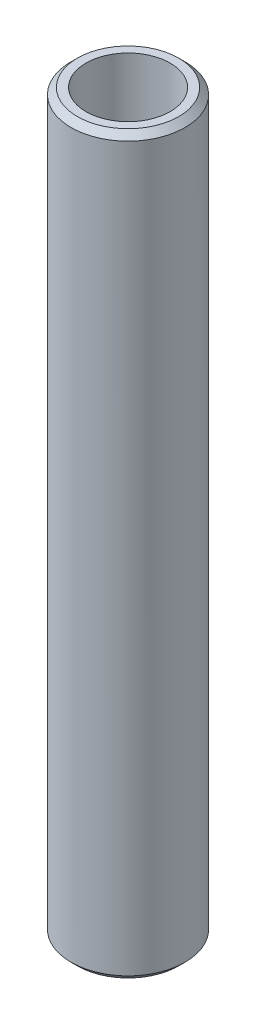
ISO-10303-21;
HEADER;
FILE_DESCRIPTION(('STEP AP214'),'2;1');
FILE_NAME('part.step','',(''),(''),'','','');
FILE_SCHEMA(('AUTOMOTIVE_DESIGN { 1 0 10303 214 1 1 1 1 }'));
ENDSEC;
DATA;
#1=APPLICATION_CONTEXT('core data for automotive mechanical design processes');
#2=APPLICATION_PROTOCOL_DEFINITION('international standard','automotive_design',2000,#1);
#3=PRODUCT_CONTEXT('',#1,'mechanical');
#4=PRODUCT('Part','Part','',(#3));
#5=PRODUCT_RELATED_PRODUCT_CATEGORY('part','',(#4));
#6=PRODUCT_DEFINITION_FORMATION('','',#4);
#7=PRODUCT_DEFINITION_CONTEXT('part definition',#1,'design');
#8=PRODUCT_DEFINITION('design','',#6,#7);
#9=PRODUCT_DEFINITION_SHAPE('','',#8);
#10=(LENGTH_UNIT() NAMED_UNIT(*) SI_UNIT(.MILLI.,.METRE.));
#11=(NAMED_UNIT(*) PLANE_ANGLE_UNIT() SI_UNIT($,.RADIAN.));
#12=(NAMED_UNIT(*) SI_UNIT($,.STERADIAN.) SOLID_ANGLE_UNIT());
#13=UNCERTAINTY_MEASURE_WITH_UNIT(LENGTH_MEASURE(1.E-05),#10,'distance_accuracy_value','');
#14=(GEOMETRIC_REPRESENTATION_CONTEXT(3) GLOBAL_UNCERTAINTY_ASSIGNED_CONTEXT((#13)) GLOBAL_UNIT_ASSIGNED_CONTEXT((#10,
#11,#12)) REPRESENTATION_CONTEXT('',''));
#15=CARTESIAN_POINT('',(0.,0.,0.));
#16=DIRECTION('',(0.,0.,1.));
#17=DIRECTION('',(1.,0.,0.));
#18=AXIS2_PLACEMENT_3D('',#15,#16,#17);
#19=CARTESIAN_POINT('',(0.,419.312782519982,0.));
#20=DIRECTION('',(0.,-1.,0.));
#21=DIRECTION('',(0.,0.,-1.));
#22=AXIS2_PLACEMENT_3D('',#19,#20,#21);
#23=CYLINDRICAL_SURFACE('',#22,32.5);
#24=CARTESIAN_POINT('',(0.,415.711285040093,0.));
#25=DIRECTION('',(0.,1.,0.));
#26=DIRECTION('',(0.,0.,1.));
#27=AXIS2_PLACEMENT_3D('',#24,#25,#26);
#28=CIRCLE('',#27,32.5);
#29=CARTESIAN_POINT('',(0.,415.711285040093,-32.5));
#30=VERTEX_POINT('',#29);
#31=EDGE_CURVE('E50',#30,#30,#28,.F.);
#32=CARTESIAN_POINT('',(0.,3.6014974798888,0.));
#33=DIRECTION('',(0.,1.,0.));
#34=DIRECTION('',(0.,0.,1.));
#35=AXIS2_PLACEMENT_3D('',#32,#33,#34);
#36=CIRCLE('',#35,32.5);
#37=CARTESIAN_POINT('',(0.,3.6014974798888,-32.5));
#38=VERTEX_POINT('',#37);
#39=EDGE_CURVE('E51',#38,#38,#36,.T.);
#40=CARTESIAN_POINT('',(0.,415.711285040093,-32.5));
#41=CARTESIAN_POINT('',(0.,411.418474753008,-32.5));
#42=CARTESIAN_POINT('',(0.,407.125664465922,-32.5));
#43=CARTESIAN_POINT('',(0.,398.540043891751,-32.5));
#44=CARTESIAN_POINT('',(0.,394.247233604666,-32.5));
#45=CARTESIAN_POINT('',(0.,385.661613030495,-32.5));
#46=CARTESIAN_POINT('',(0.,381.368802743409,-32.5));
#47=CARTESIAN_POINT('',(0.,372.783182169238,-32.5));
#48=CARTESIAN_POINT('',(0.,368.490371882153,-32.5));
#49=CARTESIAN_POINT('',(0.,359.904751307982,-32.5));
#50=CARTESIAN_POINT('',(0.,355.611941020897,-32.5));
#51=CARTESIAN_POINT('',(0.,347.026320446726,-32.5));
#52=CARTESIAN_POINT('',(0.,342.73351015964,-32.5));
#53=CARTESIAN_POINT('',(0.,334.147889585469,-32.5));
#54=CARTESIAN_POINT('',(0.,329.855079298384,-32.5));
#55=CARTESIAN_POINT('',(0.,321.269458724213,-32.5));
#56=CARTESIAN_POINT('',(0.,316.976648437127,-32.5));
#57=CARTESIAN_POINT('',(0.,308.391027862957,-32.5));
#58=CARTESIAN_POINT('',(0.,304.098217575871,-32.5));
#59=CARTESIAN_POINT('',(0.,295.5125970017,-32.5));
#60=CARTESIAN_POINT('',(0.,291.219786714615,-32.5));
#61=CARTESIAN_POINT('',(0.,282.634166140444,-32.5));
#62=CARTESIAN_POINT('',(0.,278.341355853358,-32.5));
#63=CARTESIAN_POINT('',(0.,269.755735279187,-32.5));
#64=CARTESIAN_POINT('',(0.,265.462924992102,-32.5));
#65=CARTESIAN_POINT('',(0.,256.877304417931,-32.5));
#66=CARTESIAN_POINT('',(0.,252.584494130846,-32.5));
#67=CARTESIAN_POINT('',(0.,243.998873556675,-32.5));
#68=CARTESIAN_POINT('',(0.,239.706063269589,-32.5));
#69=CARTESIAN_POINT('',(0.,231.120442695418,-32.5));
#70=CARTESIAN_POINT('',(0.,226.827632408333,-32.5));
#71=CARTESIAN_POINT('',(0.,218.242011834162,-32.5));
#72=CARTESIAN_POINT('',(0.,213.949201547076,-32.5));
#73=CARTESIAN_POINT('',(0.,205.363580972905,-32.5));
#74=CARTESIAN_POINT('',(0.,201.07077068582,-32.5));
#75=CARTESIAN_POINT('',(0.,192.485150111649,-32.5));
#76=CARTESIAN_POINT('',(0.,188.192339824564,-32.5));
#77=CARTESIAN_POINT('',(0.,179.606719250393,-32.5));
#78=CARTESIAN_POINT('',(0.,175.313908963307,-32.5));
#79=CARTESIAN_POINT('',(0.,166.728288389136,-32.5));
#80=CARTESIAN_POINT('',(0.,162.435478102051,-32.5));
#81=CARTESIAN_POINT('',(0.,153.84985752788,-32.5));
#82=CARTESIAN_POINT('',(0.,149.557047240795,-32.5));
#83=CARTESIAN_POINT('',(0.,140.971426666624,-32.5));
#84=CARTESIAN_POINT('',(0.,136.678616379538,-32.5));
#85=CARTESIAN_POINT('',(0.,128.092995805367,-32.5));
#86=CARTESIAN_POINT('',(0.,123.800185518282,-32.5));
#87=CARTESIAN_POINT('',(0.,115.214564944111,-32.5));
#88=CARTESIAN_POINT('',(0.,110.921754657025,-32.5));
#89=CARTESIAN_POINT('',(0.,102.336134082854,-32.5));
#90=CARTESIAN_POINT('',(0.,98.0433237957689,-32.5));
#91=CARTESIAN_POINT('',(0.,89.457703221598,-32.5));
#92=CARTESIAN_POINT('',(0.,85.1648929345125,-32.5));
#93=CARTESIAN_POINT('',(0.,76.5792723603416,-32.5));
#94=CARTESIAN_POINT('',(0.,72.2864620732562,-32.5));
#95=CARTESIAN_POINT('',(0.,63.7008414990853,-32.5));
#96=CARTESIAN_POINT('',(0.,59.4080312119999,-32.5));
#97=CARTESIAN_POINT('',(0.,50.8224106378289,-32.5));
#98=CARTESIAN_POINT('',(0.,46.5296003507435,-32.5));
#99=CARTESIAN_POINT('',(0.,37.9439797765725,-32.5));
#100=CARTESIAN_POINT('',(0.,33.6511694894871,-32.5));
#101=CARTESIAN_POINT('',(0.,25.0655489153161,-32.5));
#102=CARTESIAN_POINT('',(0.,20.7727386282307,-32.5));
#103=CARTESIAN_POINT('',(0.,12.1871180540597,-32.5));
#104=CARTESIAN_POINT('',(0.,7.89430776697427,-32.5));
#105=CARTESIAN_POINT('',(0.,3.6014974798888,-32.5));
#106=B_SPLINE_CURVE_WITH_KNOTS('',3,(#40,#41,#42,#43,#44,#45,#46,#47,#48,#49,#50,#51,#52,#53,
#54,#55,#56,#57,#58,#59,#60,#61,#62,#63,#64,#65,#66,#67,#68,#69,#70,#71,#72,#73,#74,#75,#76,#77,
#78,#79,#80,#81,#82,#83,#84,#85,#86,#87,#88,#89,#90,#91,#92,#93,#94,#95,#96,#97,#98,#99,#100,
#101,#102,#103,#104,#105),.UNSPECIFIED.,.F.,.F.,(4,2,2,2,2,2,2,2,2,2,2,2,2,2,2,2,2,2,2,2,2,2,2,
2,2,2,2,2,2,2,2,2,4),(0.,12.8784308612563,25.7568617225127,38.6352925837691,51.5137234450255,
64.3921543062819,77.2705851675383,90.1490160287947,103.027446890051,115.905877751307,
128.784308612564,141.66273947382,154.541170335077,167.419601196333,180.298032057589,
193.176462918846,206.054893780102,218.933324641358,231.811755502615,244.690186363871,
257.568617225128,270.447048086384,283.32547894764,296.203909808897,309.082340670153,
321.96077153141,334.839202392666,347.717633253922,360.596064115179,373.474494976435,
386.352925837691,399.231356698948,412.109787560204),.UNSPECIFIED.);
#107=EDGE_CURVE('BSEAM39',#30,#38,#106,.T.);
#108=ORIENTED_EDGE('',*,*,#31,.T.);
#109=ORIENTED_EDGE('',*,*,#39,.T.);
#110=ORIENTED_EDGE('',*,*,#107,.T.);
#111=ORIENTED_EDGE('',*,*,#107,.F.);
#112=EDGE_LOOP('',(#108,#110,#109,#111));
#113=FACE_BOUND('',#112,.T.);
#114=ADVANCED_FACE('F39',(#113),#23,.T.);
#115=CARTESIAN_POINT('',(0.,419.312782519982,0.));
#116=DIRECTION('',(0.,1.,0.));
#117=DIRECTION('',(0.,0.,1.));
#118=AXIS2_PLACEMENT_3D('',#115,#116,#117);
#119=PLANE('',#118);
#120=CARTESIAN_POINT('',(0.,419.312782519982,0.));
#121=DIRECTION('',(0.,1.,0.));
#122=DIRECTION('',(0.,0.,1.));
#123=AXIS2_PLACEMENT_3D('',#120,#121,#122);
#124=CIRCLE('',#123,28.898502520111);
#125=CARTESIAN_POINT('',(0.,419.312782519982,-28.898502520111));
#126=VERTEX_POINT('',#125);
#127=EDGE_CURVE('E54',#126,#126,#124,.T.);
#128=ORIENTED_EDGE('',*,*,#127,.T.);
#129=EDGE_LOOP('',(#128));
#130=FACE_BOUND('',#129,.T.);
#131=CARTESIAN_POINT('',(0.,419.312782519982,0.));
#132=DIRECTION('',(0.,1.,0.));
#133=DIRECTION('',(0.,0.,1.));
#134=AXIS2_PLACEMENT_3D('',#131,#132,#133);
#135=CIRCLE('',#134,24.0053779205763);
#136=CARTESIAN_POINT('',(0.,419.312782519982,24.0053779205763));
#137=VERTEX_POINT('',#136);
#138=EDGE_CURVE('E58',#137,#137,#135,.T.);
#139=ORIENTED_EDGE('',*,*,#138,.F.);
#140=EDGE_LOOP('',(#139));
#141=FACE_BOUND('',#140,.T.);
#142=ADVANCED_FACE('F69',(#130,#141),#119,.T.);
#143=CARTESIAN_POINT('',(0.,0.,0.));
#144=DIRECTION('',(0.,1.,0.));
#145=DIRECTION('',(0.,0.,1.));
#146=AXIS2_PLACEMENT_3D('',#143,#144,#145);
#147=PLANE('',#146);
#148=CARTESIAN_POINT('',(0.,0.,0.));
#149=DIRECTION('',(0.,1.,0.));
#150=DIRECTION('',(0.,0.,1.));
#151=AXIS2_PLACEMENT_3D('',#148,#149,#150);
#152=CIRCLE('',#151,28.8985025201112);
#153=CARTESIAN_POINT('',(0.,0.,28.8985025201112));
#154=VERTEX_POINT('',#153);
#155=EDGE_CURVE('E10',#154,#154,#152,.F.);
#156=ORIENTED_EDGE('',*,*,#155,.T.);
#157=EDGE_LOOP('',(#156));
#158=FACE_BOUND('',#157,.T.);
#159=CARTESIAN_POINT('',(0.,0.,0.));
#160=DIRECTION('',(0.,1.,0.));
#161=DIRECTION('',(0.,0.,1.));
#162=AXIS2_PLACEMENT_3D('',#159,#160,#161);
#163=CIRCLE('',#162,24.0053779205763);
#164=CARTESIAN_POINT('',(0.,0.,24.0053779205763));
#165=VERTEX_POINT('',#164);
#166=EDGE_CURVE('E63',#165,#165,#163,.T.);
#167=ORIENTED_EDGE('',*,*,#166,.T.);
#168=EDGE_LOOP('',(#167));
#169=FACE_BOUND('',#168,.T.);
#170=ADVANCED_FACE('F75',(#158,#169),#147,.F.);
#171=CARTESIAN_POINT('',(0.,419.312782519982,0.));
#172=DIRECTION('',(0.,-1.,0.));
#173=DIRECTION('',(0.,0.,-1.));
#174=AXIS2_PLACEMENT_3D('',#171,#172,#173);
#175=CYLINDRICAL_SURFACE('',#174,24.0053779205763);
#176=ORIENTED_EDGE('',*,*,#138,.T.);
#177=EDGE_LOOP('',(#176));
#178=FACE_BOUND('',#177,.T.);
#179=ORIENTED_EDGE('',*,*,#166,.F.);
#180=EDGE_LOOP('',(#179));
#181=FACE_BOUND('',#180,.T.);
#182=ADVANCED_FACE('F70',(#178,#181),#175,.F.);
#183=CARTESIAN_POINT('',(0.,419.312782519982,0.));
#184=DIRECTION('',(0.,-1.,0.));
#185=DIRECTION('',(0.,0.,-1.));
#186=AXIS2_PLACEMENT_3D('',#183,#184,#185);
#187=CONICAL_SURFACE('',#186,28.898502520111,0.785398163397452);
#188=CARTESIAN_POINT('',(0.,415.711285040093,-32.5));
#189=CARTESIAN_POINT('',(0.,415.748800638842,-32.4624844012512));
#190=CARTESIAN_POINT('',(0.,415.786316237591,-32.4249688025023));
#191=CARTESIAN_POINT('',(0.,415.861347435088,-32.3499376050047));
#192=CARTESIAN_POINT('',(0.,415.898863033837,-32.3124220062558));
#193=CARTESIAN_POINT('',(0.,415.973894231335,-32.2373908087581));
#194=CARTESIAN_POINT('',(0.,416.011409830084,-32.1998752100093));
#195=CARTESIAN_POINT('',(0.,416.086441027581,-32.1248440125116));
#196=CARTESIAN_POINT('',(0.,416.12395662633,-32.0873284137627));
#197=CARTESIAN_POINT('',(0.,416.198987823828,-32.0122972162651));
#198=CARTESIAN_POINT('',(0.,416.236503422577,-31.9747816175162));
#199=CARTESIAN_POINT('',(0.,416.311534620075,-31.8997504200185));
#200=CARTESIAN_POINT('',(0.,416.349050218823,-31.8622348212697));
#201=CARTESIAN_POINT('',(0.,416.424081416321,-31.787203623772));
#202=CARTESIAN_POINT('',(0.,416.46159701507,-31.7496880250232));
#203=CARTESIAN_POINT('',(0.,416.536628212568,-31.6746568275255));
#204=CARTESIAN_POINT('',(0.,416.574143811316,-31.6371412287766));
#205=CARTESIAN_POINT('',(0.,416.649175008814,-31.5621100312789));
#206=CARTESIAN_POINT('',(0.,416.686690607563,-31.5245944325301));
#207=CARTESIAN_POINT('',(0.,416.761721805061,-31.4495632350324));
#208=CARTESIAN_POINT('',(0.,416.79923740381,-31.4120476362836));
#209=CARTESIAN_POINT('',(0.,416.874268601307,-31.3370164387859));
#210=CARTESIAN_POINT('',(0.,416.911784200056,-31.299500840037));
#211=CARTESIAN_POINT('',(0.,416.986815397554,-31.2244696425393));
#212=CARTESIAN_POINT('',(0.,417.024330996303,-31.1869540437905));
#213=CARTESIAN_POINT('',(0.,417.0993621938,-31.1119228462928));
#214=CARTESIAN_POINT('',(0.,417.136877792549,-31.074407247544));
#215=CARTESIAN_POINT('',(0.,417.211908990047,-30.9993760500463));
#216=CARTESIAN_POINT('',(0.,417.249424588796,-30.9618604512974));
#217=CARTESIAN_POINT('',(0.,417.324455786293,-30.8868292537997));
#218=CARTESIAN_POINT('',(0.,417.361971385042,-30.8493136550509));
#219=CARTESIAN_POINT('',(0.,417.43700258254,-30.7742824575532));
#220=CARTESIAN_POINT('',(0.,417.474518181289,-30.7367668588044));
#221=CARTESIAN_POINT('',(0.,417.549549378786,-30.6617356613067));
#222=CARTESIAN_POINT('',(0.,417.587064977535,-30.6242200625578));
#223=CARTESIAN_POINT('',(0.,417.662096175033,-30.5491888650601));
#224=CARTESIAN_POINT('',(0.,417.699611773782,-30.5116732663113));
#225=CARTESIAN_POINT('',(0.,417.774642971279,-30.4366420688136));
#226=CARTESIAN_POINT('',(0.,417.812158570028,-30.3991264700648));
#227=CARTESIAN_POINT('',(0.,417.887189767526,-30.3240952725671));
#228=CARTESIAN_POINT('',(0.,417.924705366275,-30.2865796738183));
#229=CARTESIAN_POINT('',(0.,417.999736563773,-30.2115484763206));
#230=CARTESIAN_POINT('',(0.,418.037252162521,-30.1740328775717));
#231=CARTESIAN_POINT('',(0.,418.112283360019,-30.099001680074));
#232=CARTESIAN_POINT('',(0.,418.149798958768,-30.0614860813252));
#233=CARTESIAN_POINT('',(0.,418.224830156266,-29.9864548838275));
#234=CARTESIAN_POINT('',(0.,418.262345755014,-29.9489392850787));
#235=CARTESIAN_POINT('',(0.,418.337376952512,-29.873908087581));
#236=CARTESIAN_POINT('',(0.,418.374892551261,-29.8363924888321));
#237=CARTESIAN_POINT('',(0.,418.449923748759,-29.7613612913344));
#238=CARTESIAN_POINT('',(0.,418.487439347507,-29.7238456925856));
#239=CARTESIAN_POINT('',(0.,418.562470545005,-29.6488144950879));
#240=CARTESIAN_POINT('',(0.,418.599986143754,-29.6112988963391));
#241=CARTESIAN_POINT('',(0.,418.675017341252,-29.5362676988414));
#242=CARTESIAN_POINT('',(0.,418.712532940001,-29.4987521000925));
#243=CARTESIAN_POINT('',(0.,418.787564137498,-29.4237209025948));
#244=CARTESIAN_POINT('',(0.,418.825079736247,-29.386205303846));
#245=CARTESIAN_POINT('',(0.,418.900110933745,-29.3111741063483));
#246=CARTESIAN_POINT('',(0.,418.937626532494,-29.2736585075995));
#247=CARTESIAN_POINT('',(0.,419.012657729991,-29.1986273101018));
#248=CARTESIAN_POINT('',(0.,419.05017332874,-29.1611117113529));
#249=CARTESIAN_POINT('',(0.,419.125204526238,-29.0860805138553));
#250=CARTESIAN_POINT('',(0.,419.162720124987,-29.0485649151064));
#251=CARTESIAN_POINT('',(0.,419.237751322484,-28.9735337176087));
#252=CARTESIAN_POINT('',(0.,419.275266921233,-28.9360181188599));
#253=CARTESIAN_POINT('',(0.,419.312782519982,-28.898502520111));
#254=B_SPLINE_CURVE_WITH_KNOTS('',3,(#188,#189,#190,#191,#192,#193,#194,#195,#196,#197,#198,
#199,#200,#201,#202,#203,#204,#205,#206,#207,#208,#209,#210,#211,#212,#213,#214,#215,#216,#217,
#218,#219,#220,#221,#222,#223,#224,#225,#226,#227,#228,#229,#230,#231,#232,#233,#234,#235,#236,
#237,#238,#239,#240,#241,#242,#243,#244,#245,#246,#247,#248,#249,#250,#251,#252,#253),
.UNSPECIFIED.,.F.,.F.,(4,2,2,2,2,2,2,2,2,2,2,2,2,2,2,2,2,2,2,2,2,2,2,2,2,2,2,2,2,2,2,2,4),(0.,
0.159165205653467,0.318330411306935,0.477495616960441,0.636660822613909,0.79582602826741,
0.954991233920878,1.11415643957438,1.27332164522785,1.43248685088136,1.59165205653483,
1.75081726218833,1.9099824678418,2.0691476734953,2.22831287914877,2.38747808480228,
2.54664329045574,2.70580849610921,2.86497370176272,3.02413890741618,3.18330411306969,
3.34246931872316,3.50163452437666,3.66079973003013,3.81996493568363,3.9791301413371,
4.13829534699061,4.29746055264407,4.45662575829758,4.61579096395105,4.77495616960455,
4.93412137525802,5.09328658091153),.UNSPECIFIED.);
#255=EDGE_CURVE('BSEAM81',#30,#126,#254,.T.);
#256=ORIENTED_EDGE('',*,*,#31,.F.);
#257=ORIENTED_EDGE('',*,*,#127,.F.);
#258=ORIENTED_EDGE('',*,*,#255,.T.);
#259=ORIENTED_EDGE('',*,*,#255,.F.);
#260=EDGE_LOOP('',(#256,#258,#257,#259));
#261=FACE_BOUND('',#260,.T.);
#262=ADVANCED_FACE('F81',(#261),#187,.T.);
#263=CARTESIAN_POINT('',(0.,3.6014974798888,0.));
#264=DIRECTION('',(0.,1.,0.));
#265=DIRECTION('',(0.,0.,1.));
#266=AXIS2_PLACEMENT_3D('',#263,#264,#265);
#267=CONICAL_SURFACE('',#266,32.5,0.785398163397452);
#268=ORIENTED_EDGE('',*,*,#155,.F.);
#269=EDGE_LOOP('',(#268));
#270=FACE_BOUND('',#269,.T.);
#271=ORIENTED_EDGE('',*,*,#39,.F.);
#272=EDGE_LOOP('',(#271));
#273=FACE_BOUND('',#272,.T.);
#274=ADVANCED_FACE('F45',(#270,#273),#267,.T.);
#275=CLOSED_SHELL('',(#114,#142,#170,#182,#262,#274));
#276=MANIFOLD_SOLID_BREP('B2',#275);
#277=ADVANCED_BREP_SHAPE_REPRESENTATION('',(#18,#276),#14);
#278=SHAPE_DEFINITION_REPRESENTATION(#9,#277);
ENDSEC;
END-ISO-10303-21;
